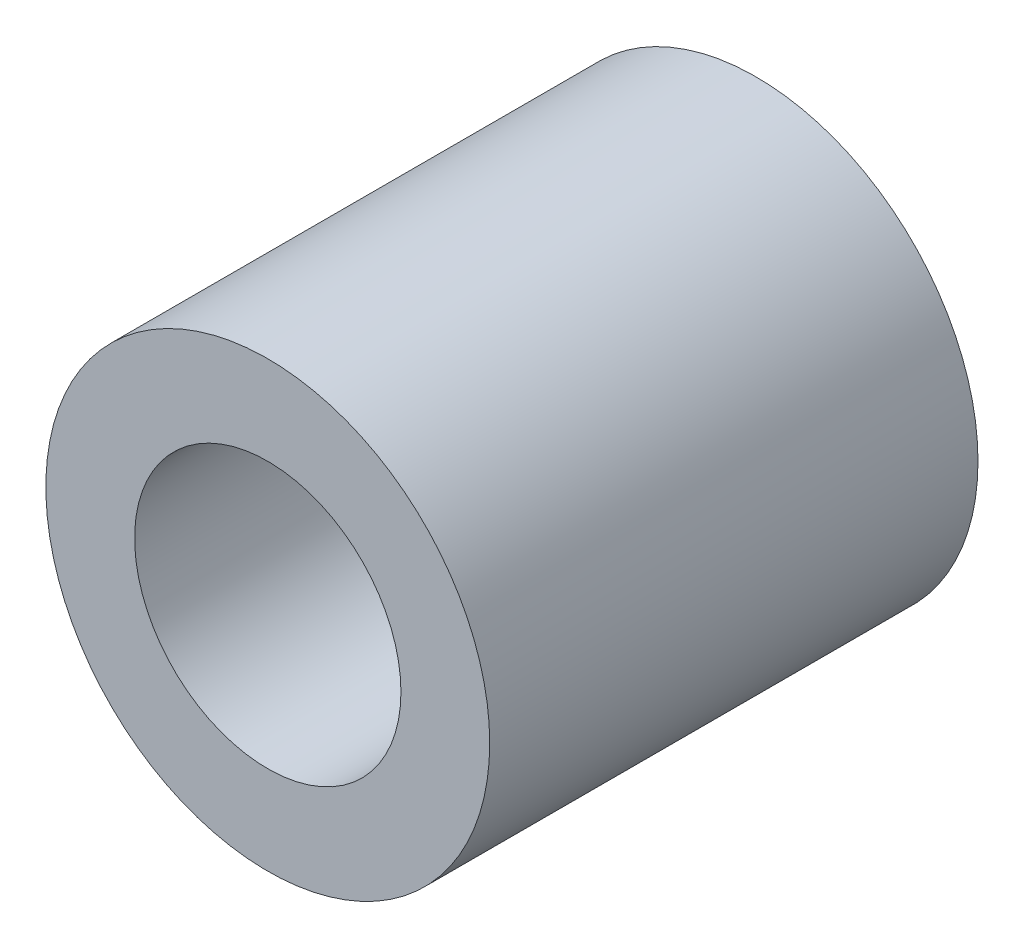
ISO-10303-21;
HEADER;
FILE_DESCRIPTION(('STEP AP214'),'2;1');
FILE_NAME('part.step','',(''),(''),'','','');
FILE_SCHEMA(('AUTOMOTIVE_DESIGN { 1 0 10303 214 1 1 1 1 }'));
ENDSEC;
DATA;
#1=APPLICATION_CONTEXT('core data for automotive mechanical design processes');
#2=APPLICATION_PROTOCOL_DEFINITION('international standard','automotive_design',2000,#1);
#3=PRODUCT_CONTEXT('',#1,'mechanical');
#4=PRODUCT('Part','Part','',(#3));
#5=PRODUCT_RELATED_PRODUCT_CATEGORY('part','',(#4));
#6=PRODUCT_DEFINITION_FORMATION('','',#4);
#7=PRODUCT_DEFINITION_CONTEXT('part definition',#1,'design');
#8=PRODUCT_DEFINITION('design','',#6,#7);
#9=PRODUCT_DEFINITION_SHAPE('','',#8);
#10=(LENGTH_UNIT() NAMED_UNIT(*) SI_UNIT(.MILLI.,.METRE.));
#11=(NAMED_UNIT(*) PLANE_ANGLE_UNIT() SI_UNIT($,.RADIAN.));
#12=(NAMED_UNIT(*) SI_UNIT($,.STERADIAN.) SOLID_ANGLE_UNIT());
#13=UNCERTAINTY_MEASURE_WITH_UNIT(LENGTH_MEASURE(1.E-05),#10,'distance_accuracy_value','');
#14=(GEOMETRIC_REPRESENTATION_CONTEXT(3) GLOBAL_UNCERTAINTY_ASSIGNED_CONTEXT((#13)) GLOBAL_UNIT_ASSIGNED_CONTEXT((#10,
#11,#12)) REPRESENTATION_CONTEXT('',''));
#15=CARTESIAN_POINT('',(0.,0.,0.));
#16=DIRECTION('',(0.,0.,1.));
#17=DIRECTION('',(1.,0.,0.));
#18=AXIS2_PLACEMENT_3D('',#15,#16,#17);
#19=CARTESIAN_POINT('',(0.,0.,55.));
#20=DIRECTION('',(0.,0.,1.));
#21=DIRECTION('',(1.,0.,0.));
#22=AXIS2_PLACEMENT_3D('',#19,#20,#21);
#23=PLANE('',#22);
#24=CARTESIAN_POINT('',(0.,0.,55.));
#25=DIRECTION('',(0.,0.,1.));
#26=DIRECTION('',(1.,0.,0.));
#27=AXIS2_PLACEMENT_3D('',#24,#25,#26);
#28=CIRCLE('',#27,25.);
#29=CARTESIAN_POINT('',(25.,0.,55.));
#30=VERTEX_POINT('',#29);
#31=EDGE_CURVE('E10',#30,#30,#28,.T.);
#32=ORIENTED_EDGE('',*,*,#31,.T.);
#33=EDGE_LOOP('',(#32));
#34=FACE_BOUND('',#33,.T.);
#35=CARTESIAN_POINT('',(0.,0.,55.));
#36=DIRECTION('',(0.,0.,1.));
#37=DIRECTION('',(1.,0.,0.));
#38=AXIS2_PLACEMENT_3D('',#35,#36,#37);
#39=CIRCLE('',#38,15.);
#40=CARTESIAN_POINT('',(15.,0.,55.));
#41=VERTEX_POINT('',#40);
#42=EDGE_CURVE('E42',#41,#41,#39,.T.);
#43=ORIENTED_EDGE('',*,*,#42,.F.);
#44=EDGE_LOOP('',(#43));
#45=FACE_BOUND('',#44,.T.);
#46=ADVANCED_FACE('F31',(#34,#45),#23,.T.);
#47=CARTESIAN_POINT('',(0.,0.,0.));
#48=DIRECTION('',(0.,0.,1.));
#49=DIRECTION('',(1.,0.,0.));
#50=AXIS2_PLACEMENT_3D('',#47,#48,#49);
#51=PLANE('',#50);
#52=CARTESIAN_POINT('',(0.,0.,0.));
#53=DIRECTION('',(0.,0.,1.));
#54=DIRECTION('',(1.,0.,0.));
#55=AXIS2_PLACEMENT_3D('',#52,#53,#54);
#56=CIRCLE('',#55,25.);
#57=CARTESIAN_POINT('',(25.,0.,0.));
#58=VERTEX_POINT('',#57);
#59=EDGE_CURVE('E35',#58,#58,#56,.T.);
#60=ORIENTED_EDGE('',*,*,#59,.F.);
#61=EDGE_LOOP('',(#60));
#62=FACE_BOUND('',#61,.T.);
#63=CARTESIAN_POINT('',(0.,0.,0.));
#64=DIRECTION('',(0.,0.,1.));
#65=DIRECTION('',(1.,0.,0.));
#66=AXIS2_PLACEMENT_3D('',#63,#64,#65);
#67=CIRCLE('',#66,15.);
#68=CARTESIAN_POINT('',(15.,0.,0.));
#69=VERTEX_POINT('',#68);
#70=EDGE_CURVE('E44',#69,#69,#67,.T.);
#71=ORIENTED_EDGE('',*,*,#70,.T.);
#72=EDGE_LOOP('',(#71));
#73=FACE_BOUND('',#72,.T.);
#74=ADVANCED_FACE('F54',(#62,#73),#51,.F.);
#75=CARTESIAN_POINT('',(0.,0.,55.));
#76=DIRECTION('',(0.,0.,-1.));
#77=DIRECTION('',(-1.,0.,0.));
#78=AXIS2_PLACEMENT_3D('',#75,#76,#77);
#79=CYLINDRICAL_SURFACE('',#78,25.);
#80=ORIENTED_EDGE('',*,*,#31,.F.);
#81=EDGE_LOOP('',(#80));
#82=FACE_BOUND('',#81,.T.);
#83=ORIENTED_EDGE('',*,*,#59,.T.);
#84=EDGE_LOOP('',(#83));
#85=FACE_BOUND('',#84,.T.);
#86=ADVANCED_FACE('F33',(#82,#85),#79,.T.);
#87=CARTESIAN_POINT('',(0.,0.,55.));
#88=DIRECTION('',(0.,0.,-1.));
#89=DIRECTION('',(-1.,0.,0.));
#90=AXIS2_PLACEMENT_3D('',#87,#88,#89);
#91=CYLINDRICAL_SURFACE('',#90,15.);
#92=ORIENTED_EDGE('',*,*,#42,.T.);
#93=EDGE_LOOP('',(#92));
#94=FACE_BOUND('',#93,.T.);
#95=ORIENTED_EDGE('',*,*,#70,.F.);
#96=EDGE_LOOP('',(#95));
#97=FACE_BOUND('',#96,.T.);
#98=ADVANCED_FACE('F50',(#94,#97),#91,.F.);
#99=CLOSED_SHELL('',(#46,#74,#86,#98));
#100=MANIFOLD_SOLID_BREP('B2',#99);
#101=ADVANCED_BREP_SHAPE_REPRESENTATION('',(#18,#100),#14);
#102=SHAPE_DEFINITION_REPRESENTATION(#9,#101);
ENDSEC;
END-ISO-10303-21;
